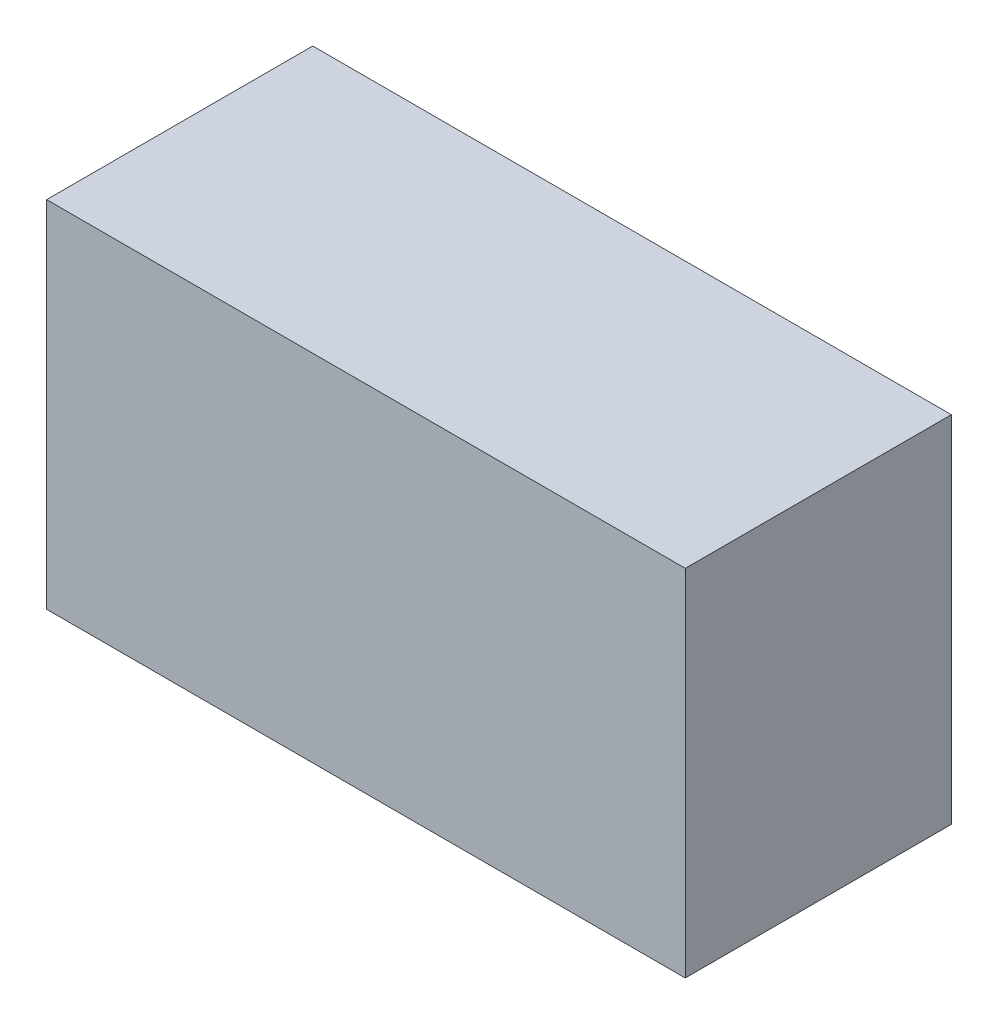
ISO-10303-21;
HEADER;
FILE_DESCRIPTION(('STEP AP214'),'2;1');
FILE_NAME('part.step','',(''),(''),'','','');
FILE_SCHEMA(('AUTOMOTIVE_DESIGN { 1 0 10303 214 1 1 1 1 }'));
ENDSEC;
DATA;
#1=APPLICATION_CONTEXT('core data for automotive mechanical design processes');
#2=APPLICATION_PROTOCOL_DEFINITION('international standard','automotive_design',2000,#1);
#3=PRODUCT_CONTEXT('',#1,'mechanical');
#4=PRODUCT('Part','Part','',(#3));
#5=PRODUCT_RELATED_PRODUCT_CATEGORY('part','',(#4));
#6=PRODUCT_DEFINITION_FORMATION('','',#4);
#7=PRODUCT_DEFINITION_CONTEXT('part definition',#1,'design');
#8=PRODUCT_DEFINITION('design','',#6,#7);
#9=PRODUCT_DEFINITION_SHAPE('','',#8);
#10=(LENGTH_UNIT() NAMED_UNIT(*) SI_UNIT(.MILLI.,.METRE.));
#11=(NAMED_UNIT(*) PLANE_ANGLE_UNIT() SI_UNIT($,.RADIAN.));
#12=(NAMED_UNIT(*) SI_UNIT($,.STERADIAN.) SOLID_ANGLE_UNIT());
#13=UNCERTAINTY_MEASURE_WITH_UNIT(LENGTH_MEASURE(1.E-05),#10,'distance_accuracy_value','');
#14=(GEOMETRIC_REPRESENTATION_CONTEXT(3) GLOBAL_UNCERTAINTY_ASSIGNED_CONTEXT((#13)) GLOBAL_UNIT_ASSIGNED_CONTEXT((#10,
#11,#12)) REPRESENTATION_CONTEXT('',''));
#15=CARTESIAN_POINT('',(0.,0.,0.));
#16=DIRECTION('',(0.,0.,1.));
#17=DIRECTION('',(1.,0.,0.));
#18=AXIS2_PLACEMENT_3D('',#15,#16,#17);
#19=CARTESIAN_POINT('',(-16.3455882352941,-10.2058823529412,15.));
#20=DIRECTION('',(0.,1.,0.));
#21=DIRECTION('',(0.,0.,1.));
#22=AXIS2_PLACEMENT_3D('',#19,#20,#21);
#23=PLANE('',#22);
#24=DIRECTION('',(1.,0.,0.));
#25=VECTOR('',#24,1.);
#26=CARTESIAN_POINT('',(-16.3455882352941,-10.2058823529412,0.));
#27=LINE('',#26,#25);
#28=CARTESIAN_POINT('',(-16.3455882352941,-10.2058823529412,0.));
#29=VERTEX_POINT('',#28);
#30=CARTESIAN_POINT('',(19.6544117647059,-10.2058823529412,0.));
#31=VERTEX_POINT('',#30);
#32=EDGE_CURVE('E110',#29,#31,#27,.T.);
#33=ORIENTED_EDGE('',*,*,#32,.T.);
#34=DIRECTION('',(0.,0.,-1.));
#35=VECTOR('',#34,1.);
#36=CARTESIAN_POINT('',(19.6544117647059,-10.2058823529412,15.));
#37=LINE('',#36,#35);
#38=CARTESIAN_POINT('',(19.6544117647059,-10.2058823529412,15.));
#39=VERTEX_POINT('',#38);
#40=EDGE_CURVE('E11',#39,#31,#37,.T.);
#41=ORIENTED_EDGE('',*,*,#40,.F.);
#42=DIRECTION('',(1.,0.,0.));
#43=VECTOR('',#42,1.);
#44=CARTESIAN_POINT('',(-16.3455882352941,-10.2058823529412,15.));
#45=LINE('',#44,#43);
#46=CARTESIAN_POINT('',(-16.3455882352941,-10.2058823529412,15.));
#47=VERTEX_POINT('',#46);
#48=EDGE_CURVE('E83',#47,#39,#45,.T.);
#49=ORIENTED_EDGE('',*,*,#48,.F.);
#50=DIRECTION('',(0.,0.,-1.));
#51=VECTOR('',#50,1.);
#52=CARTESIAN_POINT('',(-16.3455882352941,-10.2058823529412,15.));
#53=LINE('',#52,#51);
#54=EDGE_CURVE('E106',#47,#29,#53,.T.);
#55=ORIENTED_EDGE('',*,*,#54,.T.);
#56=EDGE_LOOP('',(#33,#41,#49,#55));
#57=FACE_BOUND('',#56,.T.);
#58=ADVANCED_FACE('F43',(#57),#23,.F.);
#59=CARTESIAN_POINT('',(19.6544117647059,9.79411764705882,15.));
#60=DIRECTION('',(1.,0.,0.));
#61=DIRECTION('',(0.,1.,0.));
#62=AXIS2_PLACEMENT_3D('',#59,#60,#61);
#63=PLANE('',#62);
#64=DIRECTION('',(0.,-1.,0.));
#65=VECTOR('',#64,1.);
#66=CARTESIAN_POINT('',(19.6544117647059,9.79411764705882,0.));
#67=LINE('',#66,#65);
#68=CARTESIAN_POINT('',(19.6544117647059,9.79411764705882,0.));
#69=VERTEX_POINT('',#68);
#70=EDGE_CURVE('E92',#69,#31,#67,.T.);
#71=ORIENTED_EDGE('',*,*,#70,.F.);
#72=DIRECTION('',(0.,0.,-1.));
#73=VECTOR('',#72,1.);
#74=CARTESIAN_POINT('',(19.6544117647059,9.79411764705882,15.));
#75=LINE('',#74,#73);
#76=CARTESIAN_POINT('',(19.6544117647059,9.79411764705882,15.));
#77=VERTEX_POINT('',#76);
#78=EDGE_CURVE('E52',#77,#69,#75,.T.);
#79=ORIENTED_EDGE('',*,*,#78,.F.);
#80=DIRECTION('',(0.,-1.,0.));
#81=VECTOR('',#80,1.);
#82=CARTESIAN_POINT('',(19.6544117647059,9.79411764705882,15.));
#83=LINE('',#82,#81);
#84=EDGE_CURVE('E90',#77,#39,#83,.T.);
#85=ORIENTED_EDGE('',*,*,#84,.T.);
#86=ORIENTED_EDGE('',*,*,#40,.T.);
#87=EDGE_LOOP('',(#71,#79,#85,#86));
#88=FACE_BOUND('',#87,.T.);
#89=ADVANCED_FACE('F89',(#88),#63,.T.);
#90=CARTESIAN_POINT('',(-16.3455882352941,9.79411764705882,15.));
#91=DIRECTION('',(0.,1.,0.));
#92=DIRECTION('',(0.,0.,1.));
#93=AXIS2_PLACEMENT_3D('',#90,#91,#92);
#94=PLANE('',#93);
#95=DIRECTION('',(1.,0.,0.));
#96=VECTOR('',#95,1.);
#97=CARTESIAN_POINT('',(-16.3455882352941,9.79411764705882,0.));
#98=LINE('',#97,#96);
#99=CARTESIAN_POINT('',(-16.3455882352941,9.79411764705882,0.));
#100=VERTEX_POINT('',#99);
#101=EDGE_CURVE('E116',#100,#69,#98,.T.);
#102=ORIENTED_EDGE('',*,*,#101,.F.);
#103=DIRECTION('',(0.,0.,-1.));
#104=VECTOR('',#103,1.);
#105=CARTESIAN_POINT('',(-16.3455882352941,9.79411764705882,15.));
#106=LINE('',#105,#104);
#107=CARTESIAN_POINT('',(-16.3455882352941,9.79411764705882,15.));
#108=VERTEX_POINT('',#107);
#109=EDGE_CURVE('E75',#108,#100,#106,.T.);
#110=ORIENTED_EDGE('',*,*,#109,.F.);
#111=DIRECTION('',(1.,0.,0.));
#112=VECTOR('',#111,1.);
#113=CARTESIAN_POINT('',(-16.3455882352941,9.79411764705882,15.));
#114=LINE('',#113,#112);
#115=EDGE_CURVE('E99',#108,#77,#114,.T.);
#116=ORIENTED_EDGE('',*,*,#115,.T.);
#117=ORIENTED_EDGE('',*,*,#78,.T.);
#118=EDGE_LOOP('',(#102,#110,#116,#117));
#119=FACE_BOUND('',#118,.T.);
#120=ADVANCED_FACE('F102',(#119),#94,.T.);
#121=CARTESIAN_POINT('',(-16.3455882352941,9.79411764705882,15.));
#122=DIRECTION('',(1.,0.,0.));
#123=DIRECTION('',(0.,1.,0.));
#124=AXIS2_PLACEMENT_3D('',#121,#122,#123);
#125=PLANE('',#124);
#126=DIRECTION('',(0.,-1.,0.));
#127=VECTOR('',#126,1.);
#128=CARTESIAN_POINT('',(-16.3455882352941,9.79411764705882,0.));
#129=LINE('',#128,#127);
#130=EDGE_CURVE('E78',#100,#29,#129,.T.);
#131=ORIENTED_EDGE('',*,*,#130,.T.);
#132=ORIENTED_EDGE('',*,*,#54,.F.);
#133=DIRECTION('',(0.,-1.,0.));
#134=VECTOR('',#133,1.);
#135=CARTESIAN_POINT('',(-16.3455882352941,9.79411764705882,15.));
#136=LINE('',#135,#134);
#137=EDGE_CURVE('E60',#108,#47,#136,.T.);
#138=ORIENTED_EDGE('',*,*,#137,.F.);
#139=ORIENTED_EDGE('',*,*,#109,.T.);
#140=EDGE_LOOP('',(#131,#132,#138,#139));
#141=FACE_BOUND('',#140,.T.);
#142=ADVANCED_FACE('F133',(#141),#125,.F.);
#143=CARTESIAN_POINT('',(0.,0.,15.));
#144=DIRECTION('',(0.,0.,-1.));
#145=DIRECTION('',(-1.,0.,0.));
#146=AXIS2_PLACEMENT_3D('',#143,#144,#145);
#147=PLANE('',#146);
#148=ORIENTED_EDGE('',*,*,#48,.T.);
#149=ORIENTED_EDGE('',*,*,#84,.F.);
#150=ORIENTED_EDGE('',*,*,#115,.F.);
#151=ORIENTED_EDGE('',*,*,#137,.T.);
#152=EDGE_LOOP('',(#148,#149,#150,#151));
#153=FACE_BOUND('',#152,.T.);
#154=ADVANCED_FACE('F98',(#153),#147,.F.);
#155=CARTESIAN_POINT('',(0.,0.,0.));
#156=DIRECTION('',(0.,0.,-1.));
#157=DIRECTION('',(-1.,0.,0.));
#158=AXIS2_PLACEMENT_3D('',#155,#156,#157);
#159=PLANE('',#158);
#160=ORIENTED_EDGE('',*,*,#32,.F.);
#161=ORIENTED_EDGE('',*,*,#130,.F.);
#162=ORIENTED_EDGE('',*,*,#101,.T.);
#163=ORIENTED_EDGE('',*,*,#70,.T.);
#164=EDGE_LOOP('',(#160,#161,#162,#163));
#165=FACE_BOUND('',#164,.T.);
#166=ADVANCED_FACE('F127',(#165),#159,.T.);
#167=CLOSED_SHELL('',(#58,#89,#120,#142,#154,#166));
#168=MANIFOLD_SOLID_BREP('B2',#167);
#169=ADVANCED_BREP_SHAPE_REPRESENTATION('',(#18,#168),#14);
#170=SHAPE_DEFINITION_REPRESENTATION(#9,#169);
ENDSEC;
END-ISO-10303-21;
